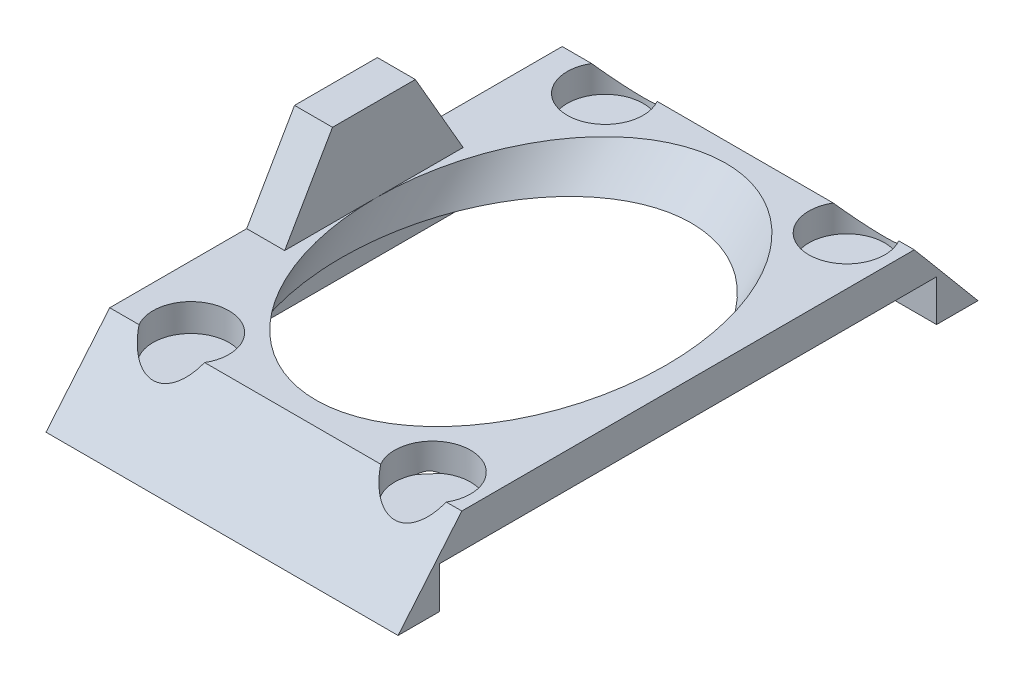
ISO-10303-21;
HEADER;
FILE_DESCRIPTION(('STEP AP214'),'2;1');
FILE_NAME('part.step','',(''),(''),'','','');
FILE_SCHEMA(('AUTOMOTIVE_DESIGN { 1 0 10303 214 1 1 1 1 }'));
ENDSEC;
DATA;
#1=APPLICATION_CONTEXT('core data for automotive mechanical design processes');
#2=APPLICATION_PROTOCOL_DEFINITION('international standard','automotive_design',2000,#1);
#3=PRODUCT_CONTEXT('',#1,'mechanical');
#4=PRODUCT('Part','Part','',(#3));
#5=PRODUCT_RELATED_PRODUCT_CATEGORY('part','',(#4));
#6=PRODUCT_DEFINITION_FORMATION('','',#4);
#7=PRODUCT_DEFINITION_CONTEXT('part definition',#1,'design');
#8=PRODUCT_DEFINITION('design','',#6,#7);
#9=PRODUCT_DEFINITION_SHAPE('','',#8);
#10=(LENGTH_UNIT() NAMED_UNIT(*) SI_UNIT(.MILLI.,.METRE.));
#11=(NAMED_UNIT(*) PLANE_ANGLE_UNIT() SI_UNIT($,.RADIAN.));
#12=(NAMED_UNIT(*) SI_UNIT($,.STERADIAN.) SOLID_ANGLE_UNIT());
#13=UNCERTAINTY_MEASURE_WITH_UNIT(LENGTH_MEASURE(1.E-05),#10,'distance_accuracy_value','');
#14=(GEOMETRIC_REPRESENTATION_CONTEXT(3) GLOBAL_UNCERTAINTY_ASSIGNED_CONTEXT((#13)) GLOBAL_UNIT_ASSIGNED_CONTEXT((#10,
#11,#12)) REPRESENTATION_CONTEXT('',''));
#15=CARTESIAN_POINT('',(0.,0.,0.));
#16=DIRECTION('',(0.,0.,1.));
#17=DIRECTION('',(1.,0.,0.));
#18=AXIS2_PLACEMENT_3D('',#15,#16,#17);
#19=CARTESIAN_POINT('',(-13.,5.5,-21.));
#20=DIRECTION('',(1.,0.,0.));
#21=DIRECTION('',(0.,0.,-1.));
#22=AXIS2_PLACEMENT_3D('',#19,#20,#21);
#23=PLANE('',#22);
#24=CARTESIAN_POINT('',(-13.,8.5,0.));
#25=DIRECTION('',(1.,0.,0.));
#26=DIRECTION('',(0.,0.,-1.));
#27=AXIS2_PLACEMENT_3D('',#24,#25,#26);
#28=CIRCLE('',#27,2.5);
#29=CARTESIAN_POINT('',(-13.,8.5,-2.5));
#30=VERTEX_POINT('',#29);
#31=EDGE_CURVE('E372',#30,#30,#28,.T.);
#32=ORIENTED_EDGE('',*,*,#31,.T.);
#33=EDGE_LOOP('',(#32));
#34=FACE_BOUND('',#33,.T.);
#35=DIRECTION('',(0.,0.,1.));
#36=VECTOR('',#35,1.);
#37=CARTESIAN_POINT('',(-13.,5.5,-21.));
#38=LINE('',#37,#36);
#39=CARTESIAN_POINT('',(-13.,5.5,-16.384952028525));
#40=VERTEX_POINT('',#39);
#41=CARTESIAN_POINT('',(-13.,5.5,-6.46410161513774));
#42=VERTEX_POINT('',#41);
#43=EDGE_CURVE('E188',#40,#42,#38,.T.);
#44=ORIENTED_EDGE('',*,*,#43,.F.);
#45=DIRECTION('',(0.,-0.766044443118982,-0.642787609686535));
#46=VECTOR('',#45,1.);
#47=CARTESIAN_POINT('',(-13.,0.,-21.));
#48=LINE('',#47,#46);
#49=CARTESIAN_POINT('',(-13.,0.,-21.));
#50=VERTEX_POINT('',#49);
#51=EDGE_CURVE('E168',#40,#50,#48,.T.);
#52=ORIENTED_EDGE('',*,*,#51,.T.);
#53=DIRECTION('',(0.,0.,1.));
#54=VECTOR('',#53,1.);
#55=CARTESIAN_POINT('',(-13.,0.,-21.));
#56=LINE('',#55,#54);
#57=CARTESIAN_POINT('',(-13.,0.,21.));
#58=VERTEX_POINT('',#57);
#59=EDGE_CURVE('E185',#50,#58,#56,.T.);
#60=ORIENTED_EDGE('',*,*,#59,.T.);
#61=DIRECTION('',(0.,0.766044443118984,-0.642787609686532));
#62=VECTOR('',#61,1.);
#63=CARTESIAN_POINT('',(-13.,0.,21.));
#64=LINE('',#63,#62);
#65=CARTESIAN_POINT('',(-13.,5.5,16.3849520285251));
#66=VERTEX_POINT('',#65);
#67=EDGE_CURVE('E287',#58,#66,#64,.T.);
#68=ORIENTED_EDGE('',*,*,#67,.T.);
#69=CARTESIAN_POINT('',(-13.,5.5,6.46410161513773));
#70=VERTEX_POINT('',#69);
#71=EDGE_CURVE('E186',#70,#66,#38,.T.);
#72=ORIENTED_EDGE('',*,*,#71,.F.);
#73=DIRECTION('',(0.,-0.86602540378444,0.499999999999998));
#74=VECTOR('',#73,1.);
#75=CARTESIAN_POINT('',(-13.,5.5,6.46410161513773));
#76=LINE('',#75,#74);
#77=CARTESIAN_POINT('',(-13.,11.5,3.));
#78=VERTEX_POINT('',#77);
#79=EDGE_CURVE('E53',#78,#70,#76,.T.);
#80=ORIENTED_EDGE('',*,*,#79,.F.);
#81=DIRECTION('',(0.,0.,1.));
#82=VECTOR('',#81,1.);
#83=CARTESIAN_POINT('',(-13.,11.5,3.));
#84=LINE('',#83,#82);
#85=CARTESIAN_POINT('',(-13.,11.5,-3.));
#86=VERTEX_POINT('',#85);
#87=EDGE_CURVE('E267',#86,#78,#84,.T.);
#88=ORIENTED_EDGE('',*,*,#87,.F.);
#89=DIRECTION('',(0.,0.86602540378444,0.499999999999998));
#90=VECTOR('',#89,1.);
#91=CARTESIAN_POINT('',(-13.,11.5,-3.));
#92=LINE('',#91,#90);
#93=EDGE_CURVE('E269',#42,#86,#92,.T.);
#94=ORIENTED_EDGE('',*,*,#93,.F.);
#95=EDGE_LOOP('',(#44,#52,#60,#68,#72,#80,#88,#94));
#96=FACE_BOUND('',#95,.T.);
#97=ADVANCED_FACE('F32',(#34,#96),#23,.F.);
#98=CARTESIAN_POINT('',(12.5,5.5,-21.));
#99=DIRECTION('',(1.,0.,0.));
#100=DIRECTION('',(0.,0.,-1.));
#101=AXIS2_PLACEMENT_3D('',#98,#99,#100);
#102=PLANE('',#101);
#103=DIRECTION('',(0.,-0.766044443118982,-0.642787609686535));
#104=VECTOR('',#103,1.);
#105=CARTESIAN_POINT('',(12.5,0.,-21.));
#106=LINE('',#105,#104);
#107=CARTESIAN_POINT('',(12.5,5.5,-16.384952028525));
#108=VERTEX_POINT('',#107);
#109=CARTESIAN_POINT('',(12.5,0.,-21.));
#110=VERTEX_POINT('',#109);
#111=EDGE_CURVE('E158',#108,#110,#106,.T.);
#112=ORIENTED_EDGE('',*,*,#111,.F.);
#113=DIRECTION('',(0.,0.,1.));
#114=VECTOR('',#113,1.);
#115=CARTESIAN_POINT('',(12.5,5.5,-21.));
#116=LINE('',#115,#114);
#117=CARTESIAN_POINT('',(12.5,5.5,16.3849520285251));
#118=VERTEX_POINT('',#117);
#119=EDGE_CURVE('E196',#108,#118,#116,.T.);
#120=ORIENTED_EDGE('',*,*,#119,.T.);
#121=DIRECTION('',(0.,0.766044443118984,-0.642787609686532));
#122=VECTOR('',#121,1.);
#123=CARTESIAN_POINT('',(12.5,0.,21.));
#124=LINE('',#123,#122);
#125=CARTESIAN_POINT('',(12.5,0.,21.));
#126=VERTEX_POINT('',#125);
#127=EDGE_CURVE('E284',#126,#118,#124,.T.);
#128=ORIENTED_EDGE('',*,*,#127,.F.);
#129=DIRECTION('',(0.,0.,1.));
#130=VECTOR('',#129,1.);
#131=CARTESIAN_POINT('',(12.5,0.,-21.));
#132=LINE('',#131,#130);
#133=CARTESIAN_POINT('',(12.5,0.,18.));
#134=VERTEX_POINT('',#133);
#135=EDGE_CURVE('E178',#134,#126,#132,.T.);
#136=ORIENTED_EDGE('',*,*,#135,.F.);
#137=DIRECTION('',(0.,-1.,0.));
#138=VECTOR('',#137,1.);
#139=CARTESIAN_POINT('',(12.5,5.5,18.));
#140=LINE('',#139,#138);
#141=CARTESIAN_POINT('',(12.5,3.,18.));
#142=VERTEX_POINT('',#141);
#143=EDGE_CURVE('E339',#142,#134,#140,.T.);
#144=ORIENTED_EDGE('',*,*,#143,.F.);
#145=DIRECTION('',(0.,0.,-1.));
#146=VECTOR('',#145,1.);
#147=CARTESIAN_POINT('',(12.5,3.,-21.));
#148=LINE('',#147,#146);
#149=CARTESIAN_POINT('',(12.5,3.,-18.));
#150=VERTEX_POINT('',#149);
#151=EDGE_CURVE('E195',#142,#150,#148,.T.);
#152=ORIENTED_EDGE('',*,*,#151,.T.);
#153=DIRECTION('',(0.,1.,0.));
#154=VECTOR('',#153,1.);
#155=CARTESIAN_POINT('',(12.5,5.5,-18.));
#156=LINE('',#155,#154);
#157=CARTESIAN_POINT('',(12.5,0.,-18.));
#158=VERTEX_POINT('',#157);
#159=EDGE_CURVE('E175',#158,#150,#156,.T.);
#160=ORIENTED_EDGE('',*,*,#159,.F.);
#161=EDGE_CURVE('E172',#110,#158,#132,.T.);
#162=ORIENTED_EDGE('',*,*,#161,.F.);
#163=EDGE_LOOP('',(#112,#120,#128,#136,#144,#152,#160,#162));
#164=FACE_BOUND('',#163,.T.);
#165=ADVANCED_FACE('F173',(#164),#102,.T.);
#166=CARTESIAN_POINT('',(0.,5.5,0.));
#167=DIRECTION('',(0.,1.,0.));
#168=DIRECTION('',(0.,0.,1.));
#169=AXIS2_PLACEMENT_3D('',#166,#167,#168);
#170=PLANE('',#169);
#171=DIRECTION('',(1.,0.,0.));
#172=VECTOR('',#171,1.);
#173=CARTESIAN_POINT('',(0.,5.5,-16.384952028525));
#174=LINE('',#173,#172);
#175=CARTESIAN_POINT('',(-10.8757962620318,5.5,-16.384952028525));
#176=VERTEX_POINT('',#175);
#177=EDGE_CURVE('E378',#40,#176,#174,.T.);
#178=ORIENTED_EDGE('',*,*,#177,.F.);
#179=ORIENTED_EDGE('',*,*,#43,.T.);
#180=DIRECTION('',(-1.,0.,0.));
#181=VECTOR('',#180,1.);
#182=CARTESIAN_POINT('',(-10.25,5.5,-6.46410161513774));
#183=LINE('',#182,#181);
#184=CARTESIAN_POINT('',(-10.25,5.5,-6.46410161513774));
#185=VERTEX_POINT('',#184);
#186=EDGE_CURVE('E281',#185,#42,#183,.T.);
#187=ORIENTED_EDGE('',*,*,#186,.F.);
#188=DIRECTION('',(0.,0.,-1.));
#189=VECTOR('',#188,1.);
#190=CARTESIAN_POINT('',(-10.25,5.5,-6.46410161513774));
#191=LINE('',#190,#189);
#192=CARTESIAN_POINT('',(-10.25,5.5,-0.140349954996816));
#193=VERTEX_POINT('',#192);
#194=EDGE_CURVE('E39',#193,#185,#191,.T.);
#195=ORIENTED_EDGE('',*,*,#194,.F.);
#196=CARTESIAN_POINT('',(0.25,5.5,-0.140349954996816));
#197=DIRECTION('',(0.,1.,0.));
#198=DIRECTION('',(0.,0.,-1.));
#199=AXIS2_PLACEMENT_3D('',#196,#197,#198);
#200=ELLIPSE('',#199,14.8492424049175,10.5);
#201=EDGE_CURVE('E202',#193,#193,#200,.T.);
#202=ORIENTED_EDGE('',*,*,#201,.F.);
#203=CARTESIAN_POINT('',(-10.25,5.5,6.46410161513773));
#204=VERTEX_POINT('',#203);
#205=EDGE_CURVE('E258',#204,#193,#191,.T.);
#206=ORIENTED_EDGE('',*,*,#205,.F.);
#207=DIRECTION('',(-1.,0.,0.));
#208=VECTOR('',#207,1.);
#209=CARTESIAN_POINT('',(-10.25,5.5,6.46410161513773));
#210=LINE('',#209,#208);
#211=EDGE_CURVE('E273',#204,#70,#210,.T.);
#212=ORIENTED_EDGE('',*,*,#211,.T.);
#213=ORIENTED_EDGE('',*,*,#71,.T.);
#214=DIRECTION('',(-1.,0.,0.));
#215=VECTOR('',#214,1.);
#216=CARTESIAN_POINT('',(0.,5.5,16.3849520285251));
#217=LINE('',#216,#215);
#218=CARTESIAN_POINT('',(-10.8757962620318,5.5,16.3849520285251));
#219=VERTEX_POINT('',#218);
#220=EDGE_CURVE('E290',#219,#66,#217,.T.);
#221=ORIENTED_EDGE('',*,*,#220,.F.);
#222=CARTESIAN_POINT('',(-8.5,5.5,15.));
#223=DIRECTION('',(0.,1.,0.));
#224=DIRECTION('',(0.,0.,-1.));
#225=AXIS2_PLACEMENT_3D('',#222,#223,#224);
#226=CIRCLE('',#225,2.75);
#227=CARTESIAN_POINT('',(-6.12420373796818,5.5,16.3849520285251));
#228=VERTEX_POINT('',#227);
#229=EDGE_CURVE('E300',#228,#219,#226,.T.);
#230=ORIENTED_EDGE('',*,*,#229,.F.);
#231=CARTESIAN_POINT('',(6.62420373796819,5.5,16.3849520285251));
#232=VERTEX_POINT('',#231);
#233=EDGE_CURVE('E293',#232,#228,#217,.T.);
#234=ORIENTED_EDGE('',*,*,#233,.F.);
#235=CARTESIAN_POINT('',(9.,5.5,15.));
#236=DIRECTION('',(0.,1.,0.));
#237=DIRECTION('',(0.,0.,-1.));
#238=AXIS2_PLACEMENT_3D('',#235,#236,#237);
#239=CIRCLE('',#238,2.75);
#240=CARTESIAN_POINT('',(11.3757962620318,5.5,16.3849520285251));
#241=VERTEX_POINT('',#240);
#242=EDGE_CURVE('E301',#241,#232,#239,.T.);
#243=ORIENTED_EDGE('',*,*,#242,.F.);
#244=EDGE_CURVE('E294',#118,#241,#217,.T.);
#245=ORIENTED_EDGE('',*,*,#244,.F.);
#246=ORIENTED_EDGE('',*,*,#119,.F.);
#247=CARTESIAN_POINT('',(11.3757962620318,5.5,-16.384952028525));
#248=VERTEX_POINT('',#247);
#249=EDGE_CURVE('E165',#248,#108,#174,.T.);
#250=ORIENTED_EDGE('',*,*,#249,.F.);
#251=CARTESIAN_POINT('',(9.,5.5,-15.));
#252=DIRECTION('',(0.,1.,0.));
#253=DIRECTION('',(0.,0.,1.));
#254=AXIS2_PLACEMENT_3D('',#251,#252,#253);
#255=CIRCLE('',#254,2.75);
#256=CARTESIAN_POINT('',(6.62420373796817,5.5,-16.384952028525));
#257=VERTEX_POINT('',#256);
#258=EDGE_CURVE('E308',#257,#248,#255,.T.);
#259=ORIENTED_EDGE('',*,*,#258,.F.);
#260=CARTESIAN_POINT('',(-6.12420373796816,5.5,-16.384952028525));
#261=VERTEX_POINT('',#260);
#262=EDGE_CURVE('E46',#261,#257,#174,.T.);
#263=ORIENTED_EDGE('',*,*,#262,.F.);
#264=CARTESIAN_POINT('',(-8.5,5.5,-15.));
#265=DIRECTION('',(0.,1.,0.));
#266=DIRECTION('',(0.,0.,1.));
#267=AXIS2_PLACEMENT_3D('',#264,#265,#266);
#268=CIRCLE('',#267,2.75);
#269=EDGE_CURVE('E307',#176,#261,#268,.T.);
#270=ORIENTED_EDGE('',*,*,#269,.F.);
#271=EDGE_LOOP('',(#178,#179,#187,#195,#202,#206,#212,#213,#221,#230,#234,#243,#245,#246,#250,
#259,#263,#270));
#272=FACE_BOUND('',#271,.T.);
#273=ADVANCED_FACE('F352',(#272),#170,.T.);
#274=CARTESIAN_POINT('',(0.,0.,0.));
#275=DIRECTION('',(0.,1.,0.));
#276=DIRECTION('',(0.,0.,1.));
#277=AXIS2_PLACEMENT_3D('',#274,#275,#276);
#278=PLANE('',#277);
#279=DIRECTION('',(0.,0.,-1.));
#280=VECTOR('',#279,1.);
#281=CARTESIAN_POINT('',(-12.,0.,18.));
#282=LINE('',#281,#280);
#283=CARTESIAN_POINT('',(-12.,0.,18.));
#284=VERTEX_POINT('',#283);
#285=CARTESIAN_POINT('',(-12.,0.,-18.));
#286=VERTEX_POINT('',#285);
#287=EDGE_CURVE('E320',#284,#286,#282,.T.);
#288=ORIENTED_EDGE('',*,*,#287,.F.);
#289=DIRECTION('',(1.,0.,0.));
#290=VECTOR('',#289,1.);
#291=CARTESIAN_POINT('',(0.,0.,18.));
#292=LINE('',#291,#290);
#293=EDGE_CURVE('E192',#284,#134,#292,.T.);
#294=ORIENTED_EDGE('',*,*,#293,.T.);
#295=ORIENTED_EDGE('',*,*,#135,.T.);
#296=DIRECTION('',(1.,0.,0.));
#297=VECTOR('',#296,1.);
#298=CARTESIAN_POINT('',(-13.,0.,21.));
#299=LINE('',#298,#297);
#300=EDGE_CURVE('E342',#58,#126,#299,.T.);
#301=ORIENTED_EDGE('',*,*,#300,.F.);
#302=ORIENTED_EDGE('',*,*,#59,.F.);
#303=DIRECTION('',(1.,0.,0.));
#304=VECTOR('',#303,1.);
#305=CARTESIAN_POINT('',(-13.,0.,-21.));
#306=LINE('',#305,#304);
#307=EDGE_CURVE('E162',#50,#110,#306,.T.);
#308=ORIENTED_EDGE('',*,*,#307,.T.);
#309=ORIENTED_EDGE('',*,*,#161,.T.);
#310=DIRECTION('',(1.,0.,0.));
#311=VECTOR('',#310,1.);
#312=CARTESIAN_POINT('',(-12.,0.,-18.));
#313=LINE('',#312,#311);
#314=EDGE_CURVE('E325',#286,#158,#313,.T.);
#315=ORIENTED_EDGE('',*,*,#314,.F.);
#316=EDGE_LOOP('',(#288,#294,#295,#301,#302,#308,#309,#315));
#317=FACE_BOUND('',#316,.T.);
#318=ADVANCED_FACE('F182',(#317),#278,.F.);
#319=CARTESIAN_POINT('',(-12.,3.,18.));
#320=DIRECTION('',(-1.,0.,0.));
#321=DIRECTION('',(0.,0.,1.));
#322=AXIS2_PLACEMENT_3D('',#319,#320,#321);
#323=PLANE('',#322);
#324=ORIENTED_EDGE('',*,*,#287,.T.);
#325=DIRECTION('',(0.,-1.,0.));
#326=VECTOR('',#325,1.);
#327=CARTESIAN_POINT('',(-12.,3.,-18.));
#328=LINE('',#327,#326);
#329=CARTESIAN_POINT('',(-12.,3.,-18.));
#330=VERTEX_POINT('',#329);
#331=EDGE_CURVE('E330',#330,#286,#328,.T.);
#332=ORIENTED_EDGE('',*,*,#331,.F.);
#333=DIRECTION('',(0.,0.,-1.));
#334=VECTOR('',#333,1.);
#335=CARTESIAN_POINT('',(-12.,3.,18.));
#336=LINE('',#335,#334);
#337=CARTESIAN_POINT('',(-12.,3.,18.));
#338=VERTEX_POINT('',#337);
#339=EDGE_CURVE('E321',#338,#330,#336,.T.);
#340=ORIENTED_EDGE('',*,*,#339,.F.);
#341=DIRECTION('',(0.,-1.,0.));
#342=VECTOR('',#341,1.);
#343=CARTESIAN_POINT('',(-12.,3.,18.));
#344=LINE('',#343,#342);
#345=EDGE_CURVE('E333',#338,#284,#344,.T.);
#346=ORIENTED_EDGE('',*,*,#345,.T.);
#347=EDGE_LOOP('',(#324,#332,#340,#346));
#348=FACE_BOUND('',#347,.T.);
#349=ADVANCED_FACE('F417',(#348),#323,.F.);
#350=CARTESIAN_POINT('',(-12.,3.,18.));
#351=DIRECTION('',(0.,0.,1.));
#352=DIRECTION('',(1.,0.,0.));
#353=AXIS2_PLACEMENT_3D('',#350,#351,#352);
#354=PLANE('',#353);
#355=ORIENTED_EDGE('',*,*,#143,.T.);
#356=ORIENTED_EDGE('',*,*,#293,.F.);
#357=ORIENTED_EDGE('',*,*,#345,.F.);
#358=DIRECTION('',(-1.,0.,0.));
#359=VECTOR('',#358,1.);
#360=CARTESIAN_POINT('',(-12.,3.,18.));
#361=LINE('',#360,#359);
#362=EDGE_CURVE('E328',#142,#338,#361,.T.);
#363=ORIENTED_EDGE('',*,*,#362,.F.);
#364=EDGE_LOOP('',(#355,#356,#357,#363));
#365=FACE_BOUND('',#364,.T.);
#366=ADVANCED_FACE('F415',(#365),#354,.F.);
#367=CARTESIAN_POINT('',(-12.,3.,-18.));
#368=DIRECTION('',(0.,0.,-1.));
#369=DIRECTION('',(-1.,0.,0.));
#370=AXIS2_PLACEMENT_3D('',#367,#368,#369);
#371=PLANE('',#370);
#372=ORIENTED_EDGE('',*,*,#159,.T.);
#373=DIRECTION('',(1.,0.,0.));
#374=VECTOR('',#373,1.);
#375=CARTESIAN_POINT('',(-12.,3.,-18.));
#376=LINE('',#375,#374);
#377=EDGE_CURVE('E324',#330,#150,#376,.T.);
#378=ORIENTED_EDGE('',*,*,#377,.F.);
#379=ORIENTED_EDGE('',*,*,#331,.T.);
#380=ORIENTED_EDGE('',*,*,#314,.T.);
#381=EDGE_LOOP('',(#372,#378,#379,#380));
#382=FACE_BOUND('',#381,.T.);
#383=ADVANCED_FACE('F410',(#382),#371,.F.);
#384=CARTESIAN_POINT('',(0.,3.,0.));
#385=DIRECTION('',(0.,-1.,0.));
#386=DIRECTION('',(0.,0.,-1.));
#387=AXIS2_PLACEMENT_3D('',#384,#385,#386);
#388=PLANE('',#387);
#389=CARTESIAN_POINT('',(0.25,3.,2.35965004500319));
#390=DIRECTION('',(0.,-1.,0.));
#391=DIRECTION('',(0.,0.,-1.));
#392=AXIS2_PLACEMENT_3D('',#389,#390,#391);
#393=ELLIPSE('',#392,14.8492424049175,10.5);
#394=CARTESIAN_POINT('',(0.25,3.,-12.4895923599143));
#395=VERTEX_POINT('',#394);
#396=EDGE_CURVE('E199',#395,#395,#393,.T.);
#397=ORIENTED_EDGE('',*,*,#396,.F.);
#398=EDGE_LOOP('',(#397));
#399=FACE_BOUND('',#398,.T.);
#400=ORIENTED_EDGE('',*,*,#362,.T.);
#401=ORIENTED_EDGE('',*,*,#339,.T.);
#402=ORIENTED_EDGE('',*,*,#377,.T.);
#403=ORIENTED_EDGE('',*,*,#151,.F.);
#404=EDGE_LOOP('',(#400,#401,#402,#403));
#405=FACE_BOUND('',#404,.T.);
#406=ADVANCED_FACE('F404',(#399,#405),#388,.T.);
#407=CARTESIAN_POINT('',(0.25,-4.57627163190825,9.93592167691147));
#408=DIRECTION('',(0.,0.707106781186546,-0.707106781186549));
#409=DIRECTION('',(0.,0.707106781186549,0.707106781186546));
#410=AXIS2_PLACEMENT_3D('',#407,#408,#409);
#411=CYLINDRICAL_SURFACE('',#410,10.5);
#412=CARTESIAN_POINT('',(0.25,3.5,1.85965004500319));
#413=DIRECTION('',(0.,-1.,0.));
#414=DIRECTION('',(0.,0.,-1.));
#415=AXIS2_PLACEMENT_3D('',#412,#413,#414);
#416=ELLIPSE('',#415,14.8492424049175,10.5);
#417=CARTESIAN_POINT('',(-6.8490603204838,3.5,12.8007050733021));
#418=VERTEX_POINT('',#417);
#419=CARTESIAN_POINT('',(-6.06369444903405,3.5,13.7244941151321));
#420=VERTEX_POINT('',#419);
#421=EDGE_CURVE('E214',#418,#420,#416,.F.);
#422=ORIENTED_EDGE('',*,*,#421,.T.);
#423=CARTESIAN_POINT('',(-6.0636944490341,3.5,13.7244941151321));
#424=CARTESIAN_POINT('',(-6.08067824752376,3.51436161378552,13.6920553388067));
#425=CARTESIAN_POINT('',(-6.09848735687849,3.5277349338271,13.6596159004293));
#426=CARTESIAN_POINT('',(-6.13580831564874,3.55227083530596,13.5948309180101));
#427=CARTESIAN_POINT('',(-6.15532203024189,3.56343095028108,13.5624855178683));
#428=CARTESIAN_POINT('',(-6.21651017478389,3.5932291198875,13.4657294897534));
#429=CARTESIAN_POINT('',(-6.2607726134098,3.60813316057418,13.4017130779568));
#430=CARTESIAN_POINT('',(-6.35588533545505,3.62607442037746,13.276192293733));
#431=CARTESIAN_POINT('',(-6.40678106790897,3.62902479379507,13.2147095063833));
#432=CARTESIAN_POINT('',(-6.51322495001803,3.62168036494825,13.0969779768327));
#433=CARTESIAN_POINT('',(-6.56876020952084,3.6114211892886,13.0407155931146));
#434=CARTESIAN_POINT('',(-6.66210157212826,3.58402552499408,12.9537467122684));
#435=CARTESIAN_POINT('',(-6.69921654620862,3.57061434537188,12.9210491649482));
#436=CARTESIAN_POINT('',(-6.77392748735465,3.53888326973966,12.8586087849837));
#437=CARTESIAN_POINT('',(-6.81152399748711,3.52055726107838,12.8288696953969));
#438=CARTESIAN_POINT('',(-6.84906032048374,3.50000000000002,12.8007050733022));
#439=B_SPLINE_CURVE_WITH_KNOTS('',3,(#423,#424,#425,#426,#427,#428,#429,#430,#431,#432,#433,
#434,#435,#436,#437,#438),.UNSPECIFIED.,.F.,.F.,(4,2,2,2,2,2,2,4),(0.,0.117957397912373,
0.236045521360655,0.472633128884083,0.710936541851911,0.948598586628396,1.1020425522986,
1.25567825087291),.UNSPECIFIED.);
#440=EDGE_CURVE('E248',#420,#418,#439,.T.);
#441=ORIENTED_EDGE('',*,*,#440,.T.);
#442=EDGE_LOOP('',(#422,#441));
#443=FACE_BOUND('',#442,.T.);
#444=CARTESIAN_POINT('',(0.25,3.5,1.85965004500319));
#445=DIRECTION('',(0.,-1.,0.));
#446=DIRECTION('',(0.,0.,-1.));
#447=AXIS2_PLACEMENT_3D('',#444,#445,#446);
#448=ELLIPSE('',#447,14.8492424049175,10.5);
#449=CARTESIAN_POINT('',(6.56369444903405,3.5,13.7244941151321));
#450=VERTEX_POINT('',#449);
#451=CARTESIAN_POINT('',(7.3490603204838,3.5,12.8007050733021));
#452=VERTEX_POINT('',#451);
#453=EDGE_CURVE('E198',#450,#452,#448,.F.);
#454=ORIENTED_EDGE('',*,*,#453,.T.);
#455=CARTESIAN_POINT('',(7.34906032048375,3.5,12.8007050733022));
#456=CARTESIAN_POINT('',(7.32040451192265,3.51567874153748,12.8222152377222));
#457=CARTESIAN_POINT('',(7.29172579359252,3.5300706982779,12.8446215106478));
#458=CARTESIAN_POINT('',(7.23452644324991,3.55607201639645,12.8912166155217));
#459=CARTESIAN_POINT('',(7.20600591831021,3.56767967548893,12.9154065262098));
#460=CARTESIAN_POINT('',(7.12148718258606,3.59782643917749,12.9902009413484));
#461=CARTESIAN_POINT('',(7.06607271002442,3.61194322871548,13.0433704894701));
#462=CARTESIAN_POINT('',(6.95894259722865,3.62749535350996,13.155380130113));
#463=CARTESIAN_POINT('',(6.90724263555683,3.62887974757834,13.2142420497953));
#464=CARTESIAN_POINT('',(6.80943674782705,3.61948482848625,13.3356616443269));
#465=CARTESIAN_POINT('',(6.76334074456401,3.60868427748591,13.3982255913147));
#466=CARTESIAN_POINT('',(6.69125703948746,3.581658335224,13.505020379225));
#467=CARTESIAN_POINT('',(6.66350811479371,3.56821210568157,13.5488205636057));
#468=CARTESIAN_POINT('',(6.61123141881838,3.5371020435968,13.6365900278892));
#469=CARTESIAN_POINT('',(6.58669098805044,3.51945561250868,13.6805578924389));
#470=CARTESIAN_POINT('',(6.56369444903411,3.50000000000001,13.7244941151321));
#471=B_SPLINE_CURVE_WITH_KNOTS('',3,(#455,#456,#457,#458,#459,#460,#461,#462,#463,#464,#465,
#466,#467,#468,#469,#470),.UNSPECIFIED.,.F.,.F.,(4,2,2,2,2,2,2,4),(0.,0.117280668008375,
0.234632858260653,0.467486678762676,0.701271723492445,0.935464875963201,1.09591299561471,
1.25570760661647),.UNSPECIFIED.);
#472=EDGE_CURVE('E206',#452,#450,#471,.T.);
#473=ORIENTED_EDGE('',*,*,#472,.T.);
#474=EDGE_LOOP('',(#454,#473));
#475=FACE_BOUND('',#474,.T.);
#476=ORIENTED_EDGE('',*,*,#201,.T.);
#477=EDGE_LOOP('',(#476));
#478=FACE_BOUND('',#477,.T.);
#479=ORIENTED_EDGE('',*,*,#396,.T.);
#480=EDGE_LOOP('',(#479));
#481=FACE_BOUND('',#480,.T.);
#482=ADVANCED_FACE('F216',(#443,#475,#478,#481),#411,.F.);
#483=CARTESIAN_POINT('',(9.,3.5,15.));
#484=DIRECTION('',(0.,1.,0.));
#485=DIRECTION('',(0.,0.,1.));
#486=AXIS2_PLACEMENT_3D('',#483,#484,#485);
#487=CYLINDRICAL_SURFACE('',#486,2.75);
#488=ORIENTED_EDGE('',*,*,#242,.T.);
#489=CARTESIAN_POINT('',(9.,7.1505215555654,15.));
#490=DIRECTION('',(0.,-0.642787609686532,-0.766044443118984));
#491=DIRECTION('',(0.,0.766044443118984,-0.642787609686532));
#492=AXIS2_PLACEMENT_3D('',#489,#490,#491);
#493=ELLIPSE('',#492,4.27824052386618,2.75);
#494=EDGE_CURVE('E295',#232,#241,#493,.F.);
#495=ORIENTED_EDGE('',*,*,#494,.T.);
#496=EDGE_LOOP('',(#488,#495));
#497=FACE_BOUND('',#496,.T.);
#498=CARTESIAN_POINT('',(9.,3.5,15.));
#499=DIRECTION('',(0.,1.,0.));
#500=DIRECTION('',(0.,0.,-1.));
#501=AXIS2_PLACEMENT_3D('',#498,#499,#500);
#502=CIRCLE('',#501,2.75);
#503=EDGE_CURVE('E298',#450,#452,#502,.T.);
#504=ORIENTED_EDGE('',*,*,#503,.F.);
#505=ORIENTED_EDGE('',*,*,#472,.F.);
#506=EDGE_LOOP('',(#504,#505));
#507=FACE_BOUND('',#506,.T.);
#508=ADVANCED_FACE('F220',(#497,#507),#487,.F.);
#509=CARTESIAN_POINT('',(9.,3.5,15.));
#510=DIRECTION('',(0.,-1.,0.));
#511=DIRECTION('',(0.,0.,-1.));
#512=AXIS2_PLACEMENT_3D('',#509,#510,#511);
#513=PLANE('',#512);
#514=ORIENTED_EDGE('',*,*,#503,.T.);
#515=ORIENTED_EDGE('',*,*,#453,.F.);
#516=EDGE_LOOP('',(#514,#515));
#517=FACE_BOUND('',#516,.T.);
#518=ADVANCED_FACE('F225',(#517),#513,.F.);
#519=CARTESIAN_POINT('',(-8.5,3.5,15.));
#520=DIRECTION('',(0.,1.,0.));
#521=DIRECTION('',(0.,0.,1.));
#522=AXIS2_PLACEMENT_3D('',#519,#520,#521);
#523=CYLINDRICAL_SURFACE('',#522,2.75);
#524=ORIENTED_EDGE('',*,*,#229,.T.);
#525=CARTESIAN_POINT('',(-8.5,7.1505215555654,15.));
#526=DIRECTION('',(0.,-0.642787609686532,-0.766044443118984));
#527=DIRECTION('',(0.,0.766044443118984,-0.642787609686532));
#528=AXIS2_PLACEMENT_3D('',#525,#526,#527);
#529=ELLIPSE('',#528,4.27824052386618,2.75);
#530=EDGE_CURVE('E253',#219,#228,#529,.F.);
#531=ORIENTED_EDGE('',*,*,#530,.T.);
#532=EDGE_LOOP('',(#524,#531));
#533=FACE_BOUND('',#532,.T.);
#534=CARTESIAN_POINT('',(-8.5,3.5,15.));
#535=DIRECTION('',(0.,1.,0.));
#536=DIRECTION('',(0.,0.,-1.));
#537=AXIS2_PLACEMENT_3D('',#534,#535,#536);
#538=CIRCLE('',#537,2.75);
#539=EDGE_CURVE('E311',#418,#420,#538,.T.);
#540=ORIENTED_EDGE('',*,*,#539,.F.);
#541=ORIENTED_EDGE('',*,*,#440,.F.);
#542=EDGE_LOOP('',(#540,#541));
#543=FACE_BOUND('',#542,.T.);
#544=ADVANCED_FACE('F242',(#533,#543),#523,.F.);
#545=CARTESIAN_POINT('',(-8.5,3.5,15.));
#546=DIRECTION('',(0.,-1.,0.));
#547=DIRECTION('',(0.,0.,-1.));
#548=AXIS2_PLACEMENT_3D('',#545,#546,#547);
#549=PLANE('',#548);
#550=ORIENTED_EDGE('',*,*,#539,.T.);
#551=ORIENTED_EDGE('',*,*,#421,.F.);
#552=EDGE_LOOP('',(#550,#551));
#553=FACE_BOUND('',#552,.T.);
#554=ADVANCED_FACE('F238',(#553),#549,.F.);
#555=CARTESIAN_POINT('',(-8.5,3.5,-15.));
#556=DIRECTION('',(0.,1.,0.));
#557=DIRECTION('',(0.,0.,1.));
#558=AXIS2_PLACEMENT_3D('',#555,#556,#557);
#559=CYLINDRICAL_SURFACE('',#558,2.75);
#560=CARTESIAN_POINT('',(-8.5,3.5,-15.));
#561=DIRECTION('',(0.,1.,0.));
#562=DIRECTION('',(0.,0.,1.));
#563=AXIS2_PLACEMENT_3D('',#560,#561,#562);
#564=CIRCLE('',#563,2.75);
#565=CARTESIAN_POINT('',(-8.5,3.5,-12.25));
#566=VERTEX_POINT('',#565);
#567=EDGE_CURVE('E203',#566,#566,#564,.T.);
#568=ORIENTED_EDGE('',*,*,#567,.F.);
#569=EDGE_LOOP('',(#568));
#570=FACE_BOUND('',#569,.T.);
#571=ORIENTED_EDGE('',*,*,#269,.T.);
#572=CARTESIAN_POINT('',(-8.5,7.15052155556534,-15.));
#573=DIRECTION('',(0.,-0.642787609686535,0.766044443118982));
#574=DIRECTION('',(0.,0.766044443118982,0.642787609686535));
#575=AXIS2_PLACEMENT_3D('',#572,#573,#574);
#576=ELLIPSE('',#575,4.27824052386616,2.75);
#577=EDGE_CURVE('E380',#261,#176,#576,.F.);
#578=ORIENTED_EDGE('',*,*,#577,.T.);
#579=EDGE_LOOP('',(#571,#578));
#580=FACE_BOUND('',#579,.T.);
#581=ADVANCED_FACE('F241',(#570,#580),#559,.F.);
#582=CARTESIAN_POINT('',(-8.5,3.5,-15.));
#583=DIRECTION('',(0.,1.,0.));
#584=DIRECTION('',(0.,0.,1.));
#585=AXIS2_PLACEMENT_3D('',#582,#583,#584);
#586=PLANE('',#585);
#587=ORIENTED_EDGE('',*,*,#567,.T.);
#588=EDGE_LOOP('',(#587));
#589=FACE_BOUND('',#588,.T.);
#590=ADVANCED_FACE('F236',(#589),#586,.T.);
#591=CARTESIAN_POINT('',(9.,3.5,-15.));
#592=DIRECTION('',(0.,1.,0.));
#593=DIRECTION('',(0.,0.,1.));
#594=AXIS2_PLACEMENT_3D('',#591,#592,#593);
#595=CYLINDRICAL_SURFACE('',#594,2.75);
#596=CARTESIAN_POINT('',(9.,3.5,-15.));
#597=DIRECTION('',(0.,1.,0.));
#598=DIRECTION('',(0.,0.,1.));
#599=AXIS2_PLACEMENT_3D('',#596,#597,#598);
#600=CIRCLE('',#599,2.75);
#601=CARTESIAN_POINT('',(9.,3.5,-12.25));
#602=VERTEX_POINT('',#601);
#603=EDGE_CURVE('E304',#602,#602,#600,.T.);
#604=ORIENTED_EDGE('',*,*,#603,.F.);
#605=EDGE_LOOP('',(#604));
#606=FACE_BOUND('',#605,.T.);
#607=ORIENTED_EDGE('',*,*,#258,.T.);
#608=CARTESIAN_POINT('',(9.,7.15052155556534,-15.));
#609=DIRECTION('',(0.,-0.642787609686535,0.766044443118982));
#610=DIRECTION('',(0.,0.766044443118982,0.642787609686535));
#611=AXIS2_PLACEMENT_3D('',#608,#609,#610);
#612=ELLIPSE('',#611,4.27824052386616,2.75);
#613=EDGE_CURVE('E11',#248,#257,#612,.F.);
#614=ORIENTED_EDGE('',*,*,#613,.T.);
#615=EDGE_LOOP('',(#607,#614));
#616=FACE_BOUND('',#615,.T.);
#617=ADVANCED_FACE('F232',(#606,#616),#595,.F.);
#618=CARTESIAN_POINT('',(9.,3.5,-15.));
#619=DIRECTION('',(0.,1.,0.));
#620=DIRECTION('',(0.,0.,1.));
#621=AXIS2_PLACEMENT_3D('',#618,#619,#620);
#622=PLANE('',#621);
#623=ORIENTED_EDGE('',*,*,#603,.T.);
#624=EDGE_LOOP('',(#623));
#625=FACE_BOUND('',#624,.T.);
#626=ADVANCED_FACE('F228',(#625),#622,.T.);
#627=CARTESIAN_POINT('',(-13.,0.,21.));
#628=DIRECTION('',(0.,-0.642787609686532,-0.766044443118984));
#629=DIRECTION('',(0.,0.766044443118984,-0.642787609686532));
#630=AXIS2_PLACEMENT_3D('',#627,#628,#629);
#631=PLANE('',#630);
#632=ORIENTED_EDGE('',*,*,#244,.T.);
#633=ORIENTED_EDGE('',*,*,#494,.F.);
#634=ORIENTED_EDGE('',*,*,#233,.T.);
#635=ORIENTED_EDGE('',*,*,#530,.F.);
#636=ORIENTED_EDGE('',*,*,#220,.T.);
#637=ORIENTED_EDGE('',*,*,#67,.F.);
#638=ORIENTED_EDGE('',*,*,#300,.T.);
#639=ORIENTED_EDGE('',*,*,#127,.T.);
#640=EDGE_LOOP('',(#632,#633,#634,#635,#636,#637,#638,#639));
#641=FACE_BOUND('',#640,.T.);
#642=ADVANCED_FACE('F231',(#641),#631,.F.);
#643=CARTESIAN_POINT('',(-10.25,11.5,-3.));
#644=DIRECTION('',(0.,-0.499999999999998,0.86602540378444));
#645=DIRECTION('',(0.,-0.86602540378444,-0.499999999999998));
#646=AXIS2_PLACEMENT_3D('',#643,#644,#645);
#647=PLANE('',#646);
#648=ORIENTED_EDGE('',*,*,#93,.T.);
#649=DIRECTION('',(-1.,0.,0.));
#650=VECTOR('',#649,1.);
#651=CARTESIAN_POINT('',(-10.25,11.5,-3.));
#652=LINE('',#651,#650);
#653=CARTESIAN_POINT('',(-10.25,11.5,-3.));
#654=VERTEX_POINT('',#653);
#655=EDGE_CURVE('E278',#654,#86,#652,.T.);
#656=ORIENTED_EDGE('',*,*,#655,.F.);
#657=DIRECTION('',(0.,0.86602540378444,0.499999999999998));
#658=VECTOR('',#657,1.);
#659=CARTESIAN_POINT('',(-10.25,11.5,-3.));
#660=LINE('',#659,#658);
#661=EDGE_CURVE('E264',#185,#654,#660,.T.);
#662=ORIENTED_EDGE('',*,*,#661,.F.);
#663=ORIENTED_EDGE('',*,*,#186,.T.);
#664=EDGE_LOOP('',(#648,#656,#662,#663));
#665=FACE_BOUND('',#664,.T.);
#666=ADVANCED_FACE('F504',(#665),#647,.F.);
#667=CARTESIAN_POINT('',(-10.25,11.5,3.));
#668=DIRECTION('',(0.,-1.,0.));
#669=DIRECTION('',(0.,0.,-1.));
#670=AXIS2_PLACEMENT_3D('',#667,#668,#669);
#671=PLANE('',#670);
#672=ORIENTED_EDGE('',*,*,#87,.T.);
#673=DIRECTION('',(-1.,0.,0.));
#674=VECTOR('',#673,1.);
#675=CARTESIAN_POINT('',(-10.25,11.5,3.));
#676=LINE('',#675,#674);
#677=CARTESIAN_POINT('',(-10.25,11.5,3.));
#678=VERTEX_POINT('',#677);
#679=EDGE_CURVE('E275',#678,#78,#676,.T.);
#680=ORIENTED_EDGE('',*,*,#679,.F.);
#681=DIRECTION('',(0.,0.,1.));
#682=VECTOR('',#681,1.);
#683=CARTESIAN_POINT('',(-10.25,11.5,3.));
#684=LINE('',#683,#682);
#685=EDGE_CURVE('E266',#654,#678,#684,.T.);
#686=ORIENTED_EDGE('',*,*,#685,.F.);
#687=ORIENTED_EDGE('',*,*,#655,.T.);
#688=EDGE_LOOP('',(#672,#680,#686,#687));
#689=FACE_BOUND('',#688,.T.);
#690=ADVANCED_FACE('F398',(#689),#671,.F.);
#691=CARTESIAN_POINT('',(-10.25,5.5,6.46410161513773));
#692=DIRECTION('',(0.,-0.499999999999998,-0.86602540378444));
#693=DIRECTION('',(0.,0.86602540378444,-0.499999999999998));
#694=AXIS2_PLACEMENT_3D('',#691,#692,#693);
#695=PLANE('',#694);
#696=ORIENTED_EDGE('',*,*,#79,.T.);
#697=ORIENTED_EDGE('',*,*,#211,.F.);
#698=DIRECTION('',(0.,-0.86602540378444,0.499999999999998));
#699=VECTOR('',#698,1.);
#700=CARTESIAN_POINT('',(-10.25,5.5,6.46410161513773));
#701=LINE('',#700,#699);
#702=EDGE_CURVE('E276',#678,#204,#701,.T.);
#703=ORIENTED_EDGE('',*,*,#702,.F.);
#704=ORIENTED_EDGE('',*,*,#679,.T.);
#705=EDGE_LOOP('',(#696,#697,#703,#704));
#706=FACE_BOUND('',#705,.T.);
#707=ADVANCED_FACE('F399',(#706),#695,.F.);
#708=CARTESIAN_POINT('',(-10.25,0.,0.));
#709=DIRECTION('',(-1.,0.,0.));
#710=DIRECTION('',(0.,0.,1.));
#711=AXIS2_PLACEMENT_3D('',#708,#709,#710);
#712=PLANE('',#711);
#713=ORIENTED_EDGE('',*,*,#205,.T.);
#714=ORIENTED_EDGE('',*,*,#194,.T.);
#715=ORIENTED_EDGE('',*,*,#661,.T.);
#716=ORIENTED_EDGE('',*,*,#685,.T.);
#717=ORIENTED_EDGE('',*,*,#702,.T.);
#718=EDGE_LOOP('',(#713,#714,#715,#716,#717));
#719=FACE_BOUND('',#718,.T.);
#720=ADVANCED_FACE('F395',(#719),#712,.F.);
#721=CARTESIAN_POINT('',(-10.75,8.5,0.));
#722=DIRECTION('',(-1.,0.,0.));
#723=DIRECTION('',(0.,0.,1.));
#724=AXIS2_PLACEMENT_3D('',#721,#722,#723);
#725=CYLINDRICAL_SURFACE('',#724,2.5);
#726=CARTESIAN_POINT('',(-10.75,8.5,0.));
#727=DIRECTION('',(1.,0.,0.));
#728=DIRECTION('',(0.,0.,-1.));
#729=AXIS2_PLACEMENT_3D('',#726,#727,#728);
#730=CIRCLE('',#729,2.5);
#731=CARTESIAN_POINT('',(-10.75,8.5,-2.5));
#732=VERTEX_POINT('',#731);
#733=EDGE_CURVE('E382',#732,#732,#730,.T.);
#734=ORIENTED_EDGE('',*,*,#733,.T.);
#735=EDGE_LOOP('',(#734));
#736=FACE_BOUND('',#735,.T.);
#737=ORIENTED_EDGE('',*,*,#31,.F.);
#738=EDGE_LOOP('',(#737));
#739=FACE_BOUND('',#738,.T.);
#740=ADVANCED_FACE('F542',(#736,#739),#725,.F.);
#741=CARTESIAN_POINT('',(-10.75,8.5,0.));
#742=DIRECTION('',(1.,0.,0.));
#743=DIRECTION('',(0.,0.,-1.));
#744=AXIS2_PLACEMENT_3D('',#741,#742,#743);
#745=PLANE('',#744);
#746=ORIENTED_EDGE('',*,*,#733,.F.);
#747=EDGE_LOOP('',(#746));
#748=FACE_BOUND('',#747,.T.);
#749=ADVANCED_FACE('F551',(#748),#745,.F.);
#750=CARTESIAN_POINT('',(-13.,0.,-21.));
#751=DIRECTION('',(0.,-0.642787609686535,0.766044443118982));
#752=DIRECTION('',(0.,-0.766044443118982,-0.642787609686535));
#753=AXIS2_PLACEMENT_3D('',#750,#751,#752);
#754=PLANE('',#753);
#755=ORIENTED_EDGE('',*,*,#177,.T.);
#756=ORIENTED_EDGE('',*,*,#577,.F.);
#757=ORIENTED_EDGE('',*,*,#262,.T.);
#758=ORIENTED_EDGE('',*,*,#613,.F.);
#759=ORIENTED_EDGE('',*,*,#249,.T.);
#760=ORIENTED_EDGE('',*,*,#111,.T.);
#761=ORIENTED_EDGE('',*,*,#307,.F.);
#762=ORIENTED_EDGE('',*,*,#51,.F.);
#763=EDGE_LOOP('',(#755,#756,#757,#758,#759,#760,#761,#762));
#764=FACE_BOUND('',#763,.T.);
#765=ADVANCED_FACE('F160',(#764),#754,.F.);
#766=CLOSED_SHELL('',(#97,#165,#273,#318,#349,#366,#383,#406,#482,#508,#518,#544,#554,#581,#590,
#617,#626,#642,#666,#690,#707,#720,#740,#749,#765));
#767=MANIFOLD_SOLID_BREP('B2',#766);
#768=ADVANCED_BREP_SHAPE_REPRESENTATION('',(#18,#767),#14);
#769=SHAPE_DEFINITION_REPRESENTATION(#9,#768);
ENDSEC;
END-ISO-10303-21;
